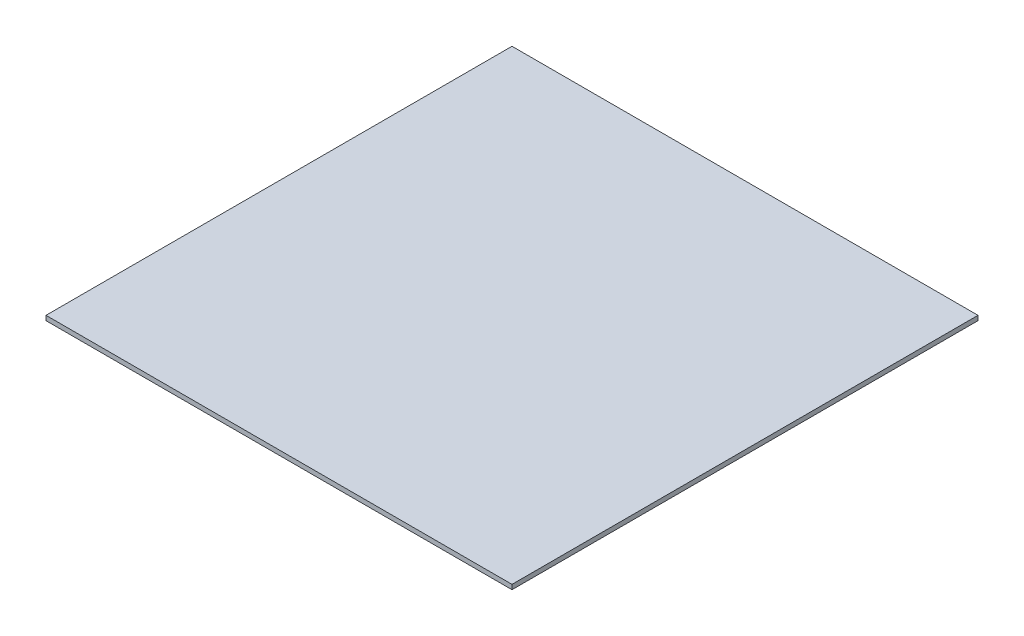
ISO-10303-21;
HEADER;
FILE_DESCRIPTION(('STEP AP214'),'2;1');
FILE_NAME('part.step','',(''),(''),'','','');
FILE_SCHEMA(('AUTOMOTIVE_DESIGN { 1 0 10303 214 1 1 1 1 }'));
ENDSEC;
DATA;
#1=APPLICATION_CONTEXT('core data for automotive mechanical design processes');
#2=APPLICATION_PROTOCOL_DEFINITION('international standard','automotive_design',2000,#1);
#3=PRODUCT_CONTEXT('',#1,'mechanical');
#4=PRODUCT('Part','Part','',(#3));
#5=PRODUCT_RELATED_PRODUCT_CATEGORY('part','',(#4));
#6=PRODUCT_DEFINITION_FORMATION('','',#4);
#7=PRODUCT_DEFINITION_CONTEXT('part definition',#1,'design');
#8=PRODUCT_DEFINITION('design','',#6,#7);
#9=PRODUCT_DEFINITION_SHAPE('','',#8);
#10=(LENGTH_UNIT() NAMED_UNIT(*) SI_UNIT(.MILLI.,.METRE.));
#11=(NAMED_UNIT(*) PLANE_ANGLE_UNIT() SI_UNIT($,.RADIAN.));
#12=(NAMED_UNIT(*) SI_UNIT($,.STERADIAN.) SOLID_ANGLE_UNIT());
#13=UNCERTAINTY_MEASURE_WITH_UNIT(LENGTH_MEASURE(1.E-05),#10,'distance_accuracy_value','');
#14=(GEOMETRIC_REPRESENTATION_CONTEXT(3) GLOBAL_UNCERTAINTY_ASSIGNED_CONTEXT((#13)) GLOBAL_UNIT_ASSIGNED_CONTEXT((#10,
#11,#12)) REPRESENTATION_CONTEXT('',''));
#15=CARTESIAN_POINT('',(0.,0.,0.));
#16=DIRECTION('',(0.,0.,1.));
#17=DIRECTION('',(1.,0.,0.));
#18=AXIS2_PLACEMENT_3D('',#15,#16,#17);
#19=CARTESIAN_POINT('',(250.,-5.,250.));
#20=DIRECTION('',(0.,0.,-1.));
#21=DIRECTION('',(-1.,0.,0.));
#22=AXIS2_PLACEMENT_3D('',#19,#20,#21);
#23=PLANE('',#22);
#24=DIRECTION('',(-1.,0.,0.));
#25=VECTOR('',#24,1.);
#26=CARTESIAN_POINT('',(250.,0.,250.));
#27=LINE('',#26,#25);
#28=CARTESIAN_POINT('',(250.,0.,250.));
#29=VERTEX_POINT('',#28);
#30=CARTESIAN_POINT('',(-250.,0.,250.));
#31=VERTEX_POINT('',#30);
#32=EDGE_CURVE('E97',#29,#31,#27,.T.);
#33=ORIENTED_EDGE('',*,*,#32,.T.);
#34=DIRECTION('',(0.,1.,0.));
#35=VECTOR('',#34,1.);
#36=CARTESIAN_POINT('',(-250.,-5.,250.));
#37=LINE('',#36,#35);
#38=CARTESIAN_POINT('',(-250.,-5.,250.));
#39=VERTEX_POINT('',#38);
#40=EDGE_CURVE('E11',#39,#31,#37,.T.);
#41=ORIENTED_EDGE('',*,*,#40,.F.);
#42=DIRECTION('',(-1.,0.,0.));
#43=VECTOR('',#42,1.);
#44=CARTESIAN_POINT('',(250.,-5.,250.));
#45=LINE('',#44,#43);
#46=CARTESIAN_POINT('',(250.,-5.,250.));
#47=VERTEX_POINT('',#46);
#48=EDGE_CURVE('E83',#47,#39,#45,.T.);
#49=ORIENTED_EDGE('',*,*,#48,.F.);
#50=DIRECTION('',(0.,1.,0.));
#51=VECTOR('',#50,1.);
#52=CARTESIAN_POINT('',(250.,-5.,250.));
#53=LINE('',#52,#51);
#54=EDGE_CURVE('E50',#47,#29,#53,.T.);
#55=ORIENTED_EDGE('',*,*,#54,.T.);
#56=EDGE_LOOP('',(#33,#41,#49,#55));
#57=FACE_BOUND('',#56,.T.);
#58=ADVANCED_FACE('F34',(#57),#23,.F.);
#59=CARTESIAN_POINT('',(-250.,-5.,250.));
#60=DIRECTION('',(1.,0.,0.));
#61=DIRECTION('',(0.,0.,-1.));
#62=AXIS2_PLACEMENT_3D('',#59,#60,#61);
#63=PLANE('',#62);
#64=DIRECTION('',(0.,0.,-1.));
#65=VECTOR('',#64,1.);
#66=CARTESIAN_POINT('',(-250.,0.,250.));
#67=LINE('',#66,#65);
#68=CARTESIAN_POINT('',(-250.,0.,-250.));
#69=VERTEX_POINT('',#68);
#70=EDGE_CURVE('E88',#31,#69,#67,.T.);
#71=ORIENTED_EDGE('',*,*,#70,.T.);
#72=DIRECTION('',(0.,1.,0.));
#73=VECTOR('',#72,1.);
#74=CARTESIAN_POINT('',(-250.,-5.,-250.));
#75=LINE('',#74,#73);
#76=CARTESIAN_POINT('',(-250.,-5.,-250.));
#77=VERTEX_POINT('',#76);
#78=EDGE_CURVE('E42',#77,#69,#75,.T.);
#79=ORIENTED_EDGE('',*,*,#78,.F.);
#80=DIRECTION('',(0.,0.,-1.));
#81=VECTOR('',#80,1.);
#82=CARTESIAN_POINT('',(-250.,-5.,250.));
#83=LINE('',#82,#81);
#84=EDGE_CURVE('E75',#39,#77,#83,.T.);
#85=ORIENTED_EDGE('',*,*,#84,.F.);
#86=ORIENTED_EDGE('',*,*,#40,.T.);
#87=EDGE_LOOP('',(#71,#79,#85,#86));
#88=FACE_BOUND('',#87,.T.);
#89=ADVANCED_FACE('F87',(#88),#63,.F.);
#90=CARTESIAN_POINT('',(250.,-5.,-250.));
#91=DIRECTION('',(0.,0.,-1.));
#92=DIRECTION('',(-1.,0.,0.));
#93=AXIS2_PLACEMENT_3D('',#90,#91,#92);
#94=PLANE('',#93);
#95=DIRECTION('',(-1.,0.,0.));
#96=VECTOR('',#95,1.);
#97=CARTESIAN_POINT('',(250.,0.,-250.));
#98=LINE('',#97,#96);
#99=CARTESIAN_POINT('',(250.,0.,-250.));
#100=VERTEX_POINT('',#99);
#101=EDGE_CURVE('E100',#100,#69,#98,.T.);
#102=ORIENTED_EDGE('',*,*,#101,.F.);
#103=DIRECTION('',(0.,1.,0.));
#104=VECTOR('',#103,1.);
#105=CARTESIAN_POINT('',(250.,-5.,-250.));
#106=LINE('',#105,#104);
#107=CARTESIAN_POINT('',(250.,-5.,-250.));
#108=VERTEX_POINT('',#107);
#109=EDGE_CURVE('E64',#108,#100,#106,.T.);
#110=ORIENTED_EDGE('',*,*,#109,.F.);
#111=DIRECTION('',(-1.,0.,0.));
#112=VECTOR('',#111,1.);
#113=CARTESIAN_POINT('',(250.,-5.,-250.));
#114=LINE('',#113,#112);
#115=EDGE_CURVE('E82',#108,#77,#114,.T.);
#116=ORIENTED_EDGE('',*,*,#115,.T.);
#117=ORIENTED_EDGE('',*,*,#78,.T.);
#118=EDGE_LOOP('',(#102,#110,#116,#117));
#119=FACE_BOUND('',#118,.T.);
#120=ADVANCED_FACE('F91',(#119),#94,.T.);
#121=CARTESIAN_POINT('',(250.,-5.,250.));
#122=DIRECTION('',(1.,0.,0.));
#123=DIRECTION('',(0.,0.,-1.));
#124=AXIS2_PLACEMENT_3D('',#121,#122,#123);
#125=PLANE('',#124);
#126=DIRECTION('',(0.,0.,-1.));
#127=VECTOR('',#126,1.);
#128=CARTESIAN_POINT('',(250.,0.,250.));
#129=LINE('',#128,#127);
#130=EDGE_CURVE('E102',#29,#100,#129,.T.);
#131=ORIENTED_EDGE('',*,*,#130,.F.);
#132=ORIENTED_EDGE('',*,*,#54,.F.);
#133=DIRECTION('',(0.,0.,-1.));
#134=VECTOR('',#133,1.);
#135=CARTESIAN_POINT('',(250.,-5.,250.));
#136=LINE('',#135,#134);
#137=EDGE_CURVE('E92',#47,#108,#136,.T.);
#138=ORIENTED_EDGE('',*,*,#137,.T.);
#139=ORIENTED_EDGE('',*,*,#109,.T.);
#140=EDGE_LOOP('',(#131,#132,#138,#139));
#141=FACE_BOUND('',#140,.T.);
#142=ADVANCED_FACE('F108',(#141),#125,.T.);
#143=CARTESIAN_POINT('',(0.,-5.,0.));
#144=DIRECTION('',(0.,-1.,0.));
#145=DIRECTION('',(0.,0.,-1.));
#146=AXIS2_PLACEMENT_3D('',#143,#144,#145);
#147=PLANE('',#146);
#148=ORIENTED_EDGE('',*,*,#48,.T.);
#149=ORIENTED_EDGE('',*,*,#84,.T.);
#150=ORIENTED_EDGE('',*,*,#115,.F.);
#151=ORIENTED_EDGE('',*,*,#137,.F.);
#152=EDGE_LOOP('',(#148,#149,#150,#151));
#153=FACE_BOUND('',#152,.T.);
#154=ADVANCED_FACE('F79',(#153),#147,.T.);
#155=CARTESIAN_POINT('',(0.,0.,0.));
#156=DIRECTION('',(0.,-1.,0.));
#157=DIRECTION('',(0.,0.,-1.));
#158=AXIS2_PLACEMENT_3D('',#155,#156,#157);
#159=PLANE('',#158);
#160=ORIENTED_EDGE('',*,*,#32,.F.);
#161=ORIENTED_EDGE('',*,*,#130,.T.);
#162=ORIENTED_EDGE('',*,*,#101,.T.);
#163=ORIENTED_EDGE('',*,*,#70,.F.);
#164=EDGE_LOOP('',(#160,#161,#162,#163));
#165=FACE_BOUND('',#164,.T.);
#166=ADVANCED_FACE('F107',(#165),#159,.F.);
#167=CLOSED_SHELL('',(#58,#89,#120,#142,#154,#166));
#168=MANIFOLD_SOLID_BREP('B2',#167);
#169=ADVANCED_BREP_SHAPE_REPRESENTATION('',(#18,#168),#14);
#170=SHAPE_DEFINITION_REPRESENTATION(#9,#169);
ENDSEC;
END-ISO-10303-21;
